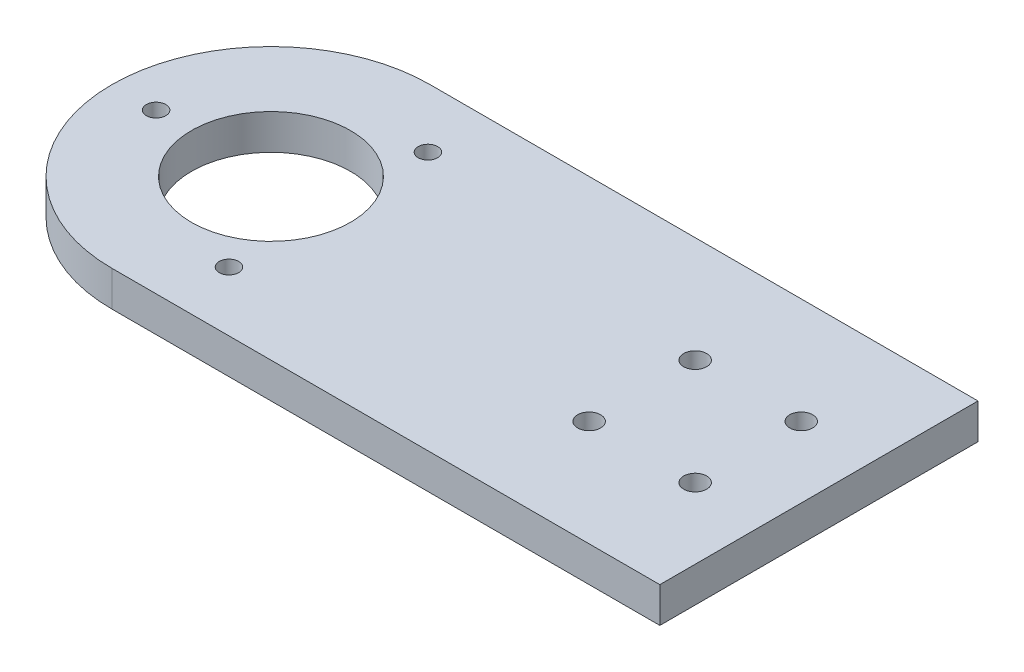
ISO-10303-21;
HEADER;
FILE_DESCRIPTION(('STEP AP214'),'2;1');
FILE_NAME('part.step','',(''),(''),'','','');
FILE_SCHEMA(('AUTOMOTIVE_DESIGN { 1 0 10303 214 1 1 1 1 }'));
ENDSEC;
DATA;
#1=APPLICATION_CONTEXT('core data for automotive mechanical design processes');
#2=APPLICATION_PROTOCOL_DEFINITION('international standard','automotive_design',2000,#1);
#3=PRODUCT_CONTEXT('',#1,'mechanical');
#4=PRODUCT('Part','Part','',(#3));
#5=PRODUCT_RELATED_PRODUCT_CATEGORY('part','',(#4));
#6=PRODUCT_DEFINITION_FORMATION('','',#4);
#7=PRODUCT_DEFINITION_CONTEXT('part definition',#1,'design');
#8=PRODUCT_DEFINITION('design','',#6,#7);
#9=PRODUCT_DEFINITION_SHAPE('','',#8);
#10=(LENGTH_UNIT() NAMED_UNIT(*) SI_UNIT(.MILLI.,.METRE.));
#11=(NAMED_UNIT(*) PLANE_ANGLE_UNIT() SI_UNIT($,.RADIAN.));
#12=(NAMED_UNIT(*) SI_UNIT($,.STERADIAN.) SOLID_ANGLE_UNIT());
#13=UNCERTAINTY_MEASURE_WITH_UNIT(LENGTH_MEASURE(1.E-05),#10,'distance_accuracy_value','');
#14=(GEOMETRIC_REPRESENTATION_CONTEXT(3) GLOBAL_UNCERTAINTY_ASSIGNED_CONTEXT((#13)) GLOBAL_UNIT_ASSIGNED_CONTEXT((#10,
#11,#12)) REPRESENTATION_CONTEXT('',''));
#15=CARTESIAN_POINT('',(0.,0.,0.));
#16=DIRECTION('',(0.,0.,1.));
#17=DIRECTION('',(1.,0.,0.));
#18=AXIS2_PLACEMENT_3D('',#15,#16,#17);
#19=CARTESIAN_POINT('',(0.,10.,-45.));
#20=DIRECTION('',(0.,0.,-1.));
#21=DIRECTION('',(-1.,0.,0.));
#22=AXIS2_PLACEMENT_3D('',#19,#20,#21);
#23=PLANE('',#22);
#24=DIRECTION('',(1.,0.,0.));
#25=VECTOR('',#24,1.);
#26=CARTESIAN_POINT('',(0.,0.,-45.));
#27=LINE('',#26,#25);
#28=CARTESIAN_POINT('',(-55.,0.,-45.));
#29=VERTEX_POINT('',#28);
#30=CARTESIAN_POINT('',(100.,0.,-45.));
#31=VERTEX_POINT('',#30);
#32=EDGE_CURVE('E98',#29,#31,#27,.T.);
#33=ORIENTED_EDGE('',*,*,#32,.F.);
#34=DIRECTION('',(0.,-1.,0.));
#35=VECTOR('',#34,1.);
#36=CARTESIAN_POINT('',(-55.,10.,-45.));
#37=LINE('',#36,#35);
#38=CARTESIAN_POINT('',(-55.,10.,-45.));
#39=VERTEX_POINT('',#38);
#40=EDGE_CURVE('E11',#39,#29,#37,.T.);
#41=ORIENTED_EDGE('',*,*,#40,.F.);
#42=DIRECTION('',(1.,0.,0.));
#43=VECTOR('',#42,1.);
#44=CARTESIAN_POINT('',(0.,10.,-45.));
#45=LINE('',#44,#43);
#46=CARTESIAN_POINT('',(100.,10.,-45.));
#47=VERTEX_POINT('',#46);
#48=EDGE_CURVE('E83',#39,#47,#45,.T.);
#49=ORIENTED_EDGE('',*,*,#48,.T.);
#50=DIRECTION('',(0.,-1.,0.));
#51=VECTOR('',#50,1.);
#52=CARTESIAN_POINT('',(100.,10.,-45.));
#53=LINE('',#52,#51);
#54=EDGE_CURVE('E51',#47,#31,#53,.T.);
#55=ORIENTED_EDGE('',*,*,#54,.T.);
#56=EDGE_LOOP('',(#33,#41,#49,#55));
#57=FACE_BOUND('',#56,.T.);
#58=ADVANCED_FACE('F35',(#57),#23,.T.);
#59=CARTESIAN_POINT('',(-55.,10.,0.));
#60=DIRECTION('',(0.,-1.,0.));
#61=DIRECTION('',(0.,0.,-1.));
#62=AXIS2_PLACEMENT_3D('',#59,#60,#61);
#63=CYLINDRICAL_SURFACE('',#62,45.);
#64=CARTESIAN_POINT('',(-55.,0.,0.));
#65=DIRECTION('',(0.,1.,0.));
#66=DIRECTION('',(0.,0.,1.));
#67=AXIS2_PLACEMENT_3D('',#64,#65,#66);
#68=CIRCLE('',#67,45.);
#69=CARTESIAN_POINT('',(-55.,0.,45.));
#70=VERTEX_POINT('',#69);
#71=EDGE_CURVE('E89',#29,#70,#68,.T.);
#72=ORIENTED_EDGE('',*,*,#71,.T.);
#73=DIRECTION('',(0.,-1.,0.));
#74=VECTOR('',#73,1.);
#75=CARTESIAN_POINT('',(-55.,10.,45.));
#76=LINE('',#75,#74);
#77=CARTESIAN_POINT('',(-55.,10.,45.));
#78=VERTEX_POINT('',#77);
#79=EDGE_CURVE('E43',#78,#70,#76,.T.);
#80=ORIENTED_EDGE('',*,*,#79,.F.);
#81=CARTESIAN_POINT('',(-55.,10.,0.));
#82=DIRECTION('',(0.,1.,0.));
#83=DIRECTION('',(0.,0.,1.));
#84=AXIS2_PLACEMENT_3D('',#81,#82,#83);
#85=CIRCLE('',#84,45.);
#86=EDGE_CURVE('E77',#39,#78,#85,.T.);
#87=ORIENTED_EDGE('',*,*,#86,.F.);
#88=ORIENTED_EDGE('',*,*,#40,.T.);
#89=EDGE_LOOP('',(#72,#80,#87,#88));
#90=FACE_BOUND('',#89,.T.);
#91=ADVANCED_FACE('F87',(#90),#63,.T.);
#92=CARTESIAN_POINT('',(0.,10.,45.));
#93=DIRECTION('',(0.,0.,1.));
#94=DIRECTION('',(1.,0.,0.));
#95=AXIS2_PLACEMENT_3D('',#92,#93,#94);
#96=PLANE('',#95);
#97=DIRECTION('',(-1.,0.,0.));
#98=VECTOR('',#97,1.);
#99=CARTESIAN_POINT('',(0.,0.,45.));
#100=LINE('',#99,#98);
#101=CARTESIAN_POINT('',(100.,0.,45.));
#102=VERTEX_POINT('',#101);
#103=EDGE_CURVE('E102',#102,#70,#100,.T.);
#104=ORIENTED_EDGE('',*,*,#103,.F.);
#105=DIRECTION('',(0.,-1.,0.));
#106=VECTOR('',#105,1.);
#107=CARTESIAN_POINT('',(100.,10.,45.));
#108=LINE('',#107,#106);
#109=CARTESIAN_POINT('',(100.,10.,45.));
#110=VERTEX_POINT('',#109);
#111=EDGE_CURVE('E64',#110,#102,#108,.T.);
#112=ORIENTED_EDGE('',*,*,#111,.F.);
#113=DIRECTION('',(-1.,0.,0.));
#114=VECTOR('',#113,1.);
#115=CARTESIAN_POINT('',(0.,10.,45.));
#116=LINE('',#115,#114);
#117=EDGE_CURVE('E82',#110,#78,#116,.T.);
#118=ORIENTED_EDGE('',*,*,#117,.T.);
#119=ORIENTED_EDGE('',*,*,#79,.T.);
#120=EDGE_LOOP('',(#104,#112,#118,#119));
#121=FACE_BOUND('',#120,.T.);
#122=ADVANCED_FACE('F92',(#121),#96,.T.);
#123=CARTESIAN_POINT('',(100.,10.,0.));
#124=DIRECTION('',(1.,0.,0.));
#125=DIRECTION('',(0.,0.,-1.));
#126=AXIS2_PLACEMENT_3D('',#123,#124,#125);
#127=PLANE('',#126);
#128=DIRECTION('',(0.,0.,1.));
#129=VECTOR('',#128,1.);
#130=CARTESIAN_POINT('',(100.,0.,0.));
#131=LINE('',#130,#129);
#132=EDGE_CURVE('E104',#31,#102,#131,.T.);
#133=ORIENTED_EDGE('',*,*,#132,.F.);
#134=ORIENTED_EDGE('',*,*,#54,.F.);
#135=DIRECTION('',(0.,0.,1.));
#136=VECTOR('',#135,1.);
#137=CARTESIAN_POINT('',(100.,10.,0.));
#138=LINE('',#137,#136);
#139=EDGE_CURVE('E93',#47,#110,#138,.T.);
#140=ORIENTED_EDGE('',*,*,#139,.T.);
#141=ORIENTED_EDGE('',*,*,#111,.T.);
#142=EDGE_LOOP('',(#133,#134,#140,#141));
#143=FACE_BOUND('',#142,.T.);
#144=ADVANCED_FACE('F163',(#143),#127,.T.);
#145=CARTESIAN_POINT('',(0.,10.,0.));
#146=DIRECTION('',(0.,1.,0.));
#147=DIRECTION('',(0.,0.,1.));
#148=AXIS2_PLACEMENT_3D('',#145,#146,#147);
#149=PLANE('',#148);
#150=CARTESIAN_POINT('',(50.,10.,15.));
#151=DIRECTION('',(0.,1.,0.));
#152=DIRECTION('',(0.,0.,1.));
#153=AXIS2_PLACEMENT_3D('',#150,#151,#152);
#154=CIRCLE('',#153,3.25);
#155=CARTESIAN_POINT('',(50.,10.,18.25));
#156=VERTEX_POINT('',#155);
#157=EDGE_CURVE('E143',#156,#156,#154,.T.);
#158=ORIENTED_EDGE('',*,*,#157,.F.);
#159=EDGE_LOOP('',(#158));
#160=FACE_BOUND('',#159,.T.);
#161=CARTESIAN_POINT('',(80.,10.,15.));
#162=DIRECTION('',(0.,1.,0.));
#163=DIRECTION('',(0.,0.,1.));
#164=AXIS2_PLACEMENT_3D('',#161,#162,#163);
#165=CIRCLE('',#164,3.25000000000001);
#166=CARTESIAN_POINT('',(80.,10.,18.25));
#167=VERTEX_POINT('',#166);
#168=EDGE_CURVE('E149',#167,#167,#165,.T.);
#169=ORIENTED_EDGE('',*,*,#168,.F.);
#170=EDGE_LOOP('',(#169));
#171=FACE_BOUND('',#170,.T.);
#172=CARTESIAN_POINT('',(80.,10.,-15.));
#173=DIRECTION('',(0.,1.,0.));
#174=DIRECTION('',(0.,0.,1.));
#175=AXIS2_PLACEMENT_3D('',#172,#173,#174);
#176=CIRCLE('',#175,3.25000000000001);
#177=CARTESIAN_POINT('',(80.,10.,-11.75));
#178=VERTEX_POINT('',#177);
#179=EDGE_CURVE('E137',#178,#178,#176,.T.);
#180=ORIENTED_EDGE('',*,*,#179,.F.);
#181=EDGE_LOOP('',(#180));
#182=FACE_BOUND('',#181,.T.);
#183=CARTESIAN_POINT('',(50.,10.,-15.));
#184=DIRECTION('',(0.,1.,0.));
#185=DIRECTION('',(0.,0.,1.));
#186=AXIS2_PLACEMENT_3D('',#183,#184,#185);
#187=CIRCLE('',#186,3.25);
#188=CARTESIAN_POINT('',(50.,10.,-11.75));
#189=VERTEX_POINT('',#188);
#190=EDGE_CURVE('E134',#189,#189,#187,.T.);
#191=ORIENTED_EDGE('',*,*,#190,.F.);
#192=EDGE_LOOP('',(#191));
#193=FACE_BOUND('',#192,.T.);
#194=CARTESIAN_POINT('',(-87.5,10.,0.));
#195=DIRECTION('',(0.,1.,0.));
#196=DIRECTION('',(0.,0.,1.));
#197=AXIS2_PLACEMENT_3D('',#194,#195,#196);
#198=CIRCLE('',#197,2.75000000000001);
#199=CARTESIAN_POINT('',(-87.5,10.,2.75000000000001));
#200=VERTEX_POINT('',#199);
#201=EDGE_CURVE('E129',#200,#200,#198,.T.);
#202=ORIENTED_EDGE('',*,*,#201,.F.);
#203=EDGE_LOOP('',(#202));
#204=FACE_BOUND('',#203,.T.);
#205=CARTESIAN_POINT('',(-55.,10.,0.));
#206=DIRECTION('',(0.,1.,0.));
#207=DIRECTION('',(0.,0.,1.));
#208=AXIS2_PLACEMENT_3D('',#205,#206,#207);
#209=CIRCLE('',#208,22.5);
#210=CARTESIAN_POINT('',(-55.,10.,22.5));
#211=VERTEX_POINT('',#210);
#212=EDGE_CURVE('E123',#211,#211,#209,.T.);
#213=ORIENTED_EDGE('',*,*,#212,.F.);
#214=EDGE_LOOP('',(#213));
#215=FACE_BOUND('',#214,.T.);
#216=CARTESIAN_POINT('',(-38.7499999999999,10.,-28.1458256229942));
#217=DIRECTION('',(0.,1.,0.));
#218=DIRECTION('',(0.,0.,1.));
#219=AXIS2_PLACEMENT_3D('',#216,#217,#218);
#220=CIRCLE('',#219,2.75000000000002);
#221=CARTESIAN_POINT('',(-38.7499999999999,10.,-25.3958256229942));
#222=VERTEX_POINT('',#221);
#223=EDGE_CURVE('E117',#222,#222,#220,.T.);
#224=ORIENTED_EDGE('',*,*,#223,.F.);
#225=EDGE_LOOP('',(#224));
#226=FACE_BOUND('',#225,.T.);
#227=CARTESIAN_POINT('',(-38.7500000000003,10.,28.1458256229944));
#228=DIRECTION('',(0.,1.,0.));
#229=DIRECTION('',(0.,0.,1.));
#230=AXIS2_PLACEMENT_3D('',#227,#228,#229);
#231=CIRCLE('',#230,2.75);
#232=CARTESIAN_POINT('',(-38.7500000000003,10.,30.8958256229944));
#233=VERTEX_POINT('',#232);
#234=EDGE_CURVE('E110',#233,#233,#231,.T.);
#235=ORIENTED_EDGE('',*,*,#234,.F.);
#236=EDGE_LOOP('',(#235));
#237=FACE_BOUND('',#236,.T.);
#238=ORIENTED_EDGE('',*,*,#48,.F.);
#239=ORIENTED_EDGE('',*,*,#86,.T.);
#240=ORIENTED_EDGE('',*,*,#117,.F.);
#241=ORIENTED_EDGE('',*,*,#139,.F.);
#242=EDGE_LOOP('',(#238,#239,#240,#241));
#243=FACE_BOUND('',#242,.T.);
#244=ADVANCED_FACE('F79',(#160,#171,#182,#193,#204,#215,#226,#237,#243),#149,.T.);
#245=CARTESIAN_POINT('',(0.,0.,0.));
#246=DIRECTION('',(0.,1.,0.));
#247=DIRECTION('',(0.,0.,1.));
#248=AXIS2_PLACEMENT_3D('',#245,#246,#247);
#249=PLANE('',#248);
#250=CARTESIAN_POINT('',(50.,0.,15.));
#251=DIRECTION('',(0.,1.,0.));
#252=DIRECTION('',(0.,0.,1.));
#253=AXIS2_PLACEMENT_3D('',#250,#251,#252);
#254=CIRCLE('',#253,3.25);
#255=CARTESIAN_POINT('',(50.,0.,18.25));
#256=VERTEX_POINT('',#255);
#257=EDGE_CURVE('E140',#256,#256,#254,.T.);
#258=ORIENTED_EDGE('',*,*,#257,.T.);
#259=EDGE_LOOP('',(#258));
#260=FACE_BOUND('',#259,.T.);
#261=CARTESIAN_POINT('',(80.,0.,15.));
#262=DIRECTION('',(0.,1.,0.));
#263=DIRECTION('',(0.,0.,1.));
#264=AXIS2_PLACEMENT_3D('',#261,#262,#263);
#265=CIRCLE('',#264,3.25000000000001);
#266=CARTESIAN_POINT('',(80.,0.,18.25));
#267=VERTEX_POINT('',#266);
#268=EDGE_CURVE('E146',#267,#267,#265,.T.);
#269=ORIENTED_EDGE('',*,*,#268,.T.);
#270=EDGE_LOOP('',(#269));
#271=FACE_BOUND('',#270,.T.);
#272=CARTESIAN_POINT('',(80.,0.,-15.));
#273=DIRECTION('',(0.,1.,0.));
#274=DIRECTION('',(0.,0.,1.));
#275=AXIS2_PLACEMENT_3D('',#272,#273,#274);
#276=CIRCLE('',#275,3.25000000000001);
#277=CARTESIAN_POINT('',(80.,0.,-11.75));
#278=VERTEX_POINT('',#277);
#279=EDGE_CURVE('E152',#278,#278,#276,.T.);
#280=ORIENTED_EDGE('',*,*,#279,.T.);
#281=EDGE_LOOP('',(#280));
#282=FACE_BOUND('',#281,.T.);
#283=CARTESIAN_POINT('',(50.,0.,-15.));
#284=DIRECTION('',(0.,1.,0.));
#285=DIRECTION('',(0.,0.,1.));
#286=AXIS2_PLACEMENT_3D('',#283,#284,#285);
#287=CIRCLE('',#286,3.25);
#288=CARTESIAN_POINT('',(50.,0.,-11.75));
#289=VERTEX_POINT('',#288);
#290=EDGE_CURVE('E114',#289,#289,#287,.T.);
#291=ORIENTED_EDGE('',*,*,#290,.T.);
#292=EDGE_LOOP('',(#291));
#293=FACE_BOUND('',#292,.T.);
#294=CARTESIAN_POINT('',(-87.5,0.,0.));
#295=DIRECTION('',(0.,1.,0.));
#296=DIRECTION('',(0.,0.,1.));
#297=AXIS2_PLACEMENT_3D('',#294,#295,#296);
#298=CIRCLE('',#297,2.75000000000001);
#299=CARTESIAN_POINT('',(-87.5,0.,2.75000000000001));
#300=VERTEX_POINT('',#299);
#301=EDGE_CURVE('E100',#300,#300,#298,.T.);
#302=ORIENTED_EDGE('',*,*,#301,.T.);
#303=EDGE_LOOP('',(#302));
#304=FACE_BOUND('',#303,.T.);
#305=CARTESIAN_POINT('',(-55.,0.,0.));
#306=DIRECTION('',(0.,1.,0.));
#307=DIRECTION('',(0.,0.,1.));
#308=AXIS2_PLACEMENT_3D('',#305,#306,#307);
#309=CIRCLE('',#308,22.5);
#310=CARTESIAN_POINT('',(-55.,0.,22.5));
#311=VERTEX_POINT('',#310);
#312=EDGE_CURVE('E126',#311,#311,#309,.T.);
#313=ORIENTED_EDGE('',*,*,#312,.T.);
#314=EDGE_LOOP('',(#313));
#315=FACE_BOUND('',#314,.T.);
#316=CARTESIAN_POINT('',(-38.7499999999999,0.,-28.1458256229942));
#317=DIRECTION('',(0.,1.,0.));
#318=DIRECTION('',(0.,0.,1.));
#319=AXIS2_PLACEMENT_3D('',#316,#317,#318);
#320=CIRCLE('',#319,2.75000000000002);
#321=CARTESIAN_POINT('',(-38.7499999999999,0.,-25.3958256229942));
#322=VERTEX_POINT('',#321);
#323=EDGE_CURVE('E120',#322,#322,#320,.T.);
#324=ORIENTED_EDGE('',*,*,#323,.T.);
#325=EDGE_LOOP('',(#324));
#326=FACE_BOUND('',#325,.T.);
#327=CARTESIAN_POINT('',(-38.7500000000003,0.,28.1458256229944));
#328=DIRECTION('',(0.,1.,0.));
#329=DIRECTION('',(0.,0.,1.));
#330=AXIS2_PLACEMENT_3D('',#327,#328,#329);
#331=CIRCLE('',#330,2.75);
#332=CARTESIAN_POINT('',(-38.7500000000003,0.,30.8958256229944));
#333=VERTEX_POINT('',#332);
#334=EDGE_CURVE('E113',#333,#333,#331,.T.);
#335=ORIENTED_EDGE('',*,*,#334,.T.);
#336=EDGE_LOOP('',(#335));
#337=FACE_BOUND('',#336,.T.);
#338=ORIENTED_EDGE('',*,*,#32,.T.);
#339=ORIENTED_EDGE('',*,*,#132,.T.);
#340=ORIENTED_EDGE('',*,*,#103,.T.);
#341=ORIENTED_EDGE('',*,*,#71,.F.);
#342=EDGE_LOOP('',(#338,#339,#340,#341));
#343=FACE_BOUND('',#342,.T.);
#344=ADVANCED_FACE('F162',(#260,#271,#282,#293,#304,#315,#326,#337,#343),#249,.F.);
#345=CARTESIAN_POINT('',(-38.7500000000003,0.,28.1458256229944));
#346=DIRECTION('',(0.,1.,0.));
#347=DIRECTION('',(0.,0.,1.));
#348=AXIS2_PLACEMENT_3D('',#345,#346,#347);
#349=CYLINDRICAL_SURFACE('',#348,2.75);
#350=ORIENTED_EDGE('',*,*,#334,.F.);
#351=EDGE_LOOP('',(#350));
#352=FACE_BOUND('',#351,.T.);
#353=ORIENTED_EDGE('',*,*,#234,.T.);
#354=EDGE_LOOP('',(#353));
#355=FACE_BOUND('',#354,.T.);
#356=ADVANCED_FACE('F176',(#352,#355),#349,.F.);
#357=CARTESIAN_POINT('',(-38.7499999999999,0.,-28.1458256229942));
#358=DIRECTION('',(0.,1.,0.));
#359=DIRECTION('',(0.,0.,1.));
#360=AXIS2_PLACEMENT_3D('',#357,#358,#359);
#361=CYLINDRICAL_SURFACE('',#360,2.75000000000002);
#362=ORIENTED_EDGE('',*,*,#323,.F.);
#363=EDGE_LOOP('',(#362));
#364=FACE_BOUND('',#363,.T.);
#365=ORIENTED_EDGE('',*,*,#223,.T.);
#366=EDGE_LOOP('',(#365));
#367=FACE_BOUND('',#366,.T.);
#368=ADVANCED_FACE('F178',(#364,#367),#361,.F.);
#369=CARTESIAN_POINT('',(-55.,0.,0.));
#370=DIRECTION('',(0.,1.,0.));
#371=DIRECTION('',(0.,0.,1.));
#372=AXIS2_PLACEMENT_3D('',#369,#370,#371);
#373=CYLINDRICAL_SURFACE('',#372,22.5);
#374=ORIENTED_EDGE('',*,*,#312,.F.);
#375=EDGE_LOOP('',(#374));
#376=FACE_BOUND('',#375,.T.);
#377=ORIENTED_EDGE('',*,*,#212,.T.);
#378=EDGE_LOOP('',(#377));
#379=FACE_BOUND('',#378,.T.);
#380=ADVANCED_FACE('F185',(#376,#379),#373,.F.);
#381=CARTESIAN_POINT('',(-87.5,0.,0.));
#382=DIRECTION('',(0.,1.,0.));
#383=DIRECTION('',(0.,0.,1.));
#384=AXIS2_PLACEMENT_3D('',#381,#382,#383);
#385=CYLINDRICAL_SURFACE('',#384,2.75000000000001);
#386=ORIENTED_EDGE('',*,*,#301,.F.);
#387=EDGE_LOOP('',(#386));
#388=FACE_BOUND('',#387,.T.);
#389=ORIENTED_EDGE('',*,*,#201,.T.);
#390=EDGE_LOOP('',(#389));
#391=FACE_BOUND('',#390,.T.);
#392=ADVANCED_FACE('F248',(#388,#391),#385,.F.);
#393=CARTESIAN_POINT('',(50.,0.,-15.));
#394=DIRECTION('',(0.,1.,0.));
#395=DIRECTION('',(0.,0.,1.));
#396=AXIS2_PLACEMENT_3D('',#393,#394,#395);
#397=CYLINDRICAL_SURFACE('',#396,3.25);
#398=ORIENTED_EDGE('',*,*,#290,.F.);
#399=EDGE_LOOP('',(#398));
#400=FACE_BOUND('',#399,.T.);
#401=ORIENTED_EDGE('',*,*,#190,.T.);
#402=EDGE_LOOP('',(#401));
#403=FACE_BOUND('',#402,.T.);
#404=ADVANCED_FACE('F256',(#400,#403),#397,.F.);
#405=CARTESIAN_POINT('',(80.,0.,-15.));
#406=DIRECTION('',(0.,1.,0.));
#407=DIRECTION('',(0.,0.,1.));
#408=AXIS2_PLACEMENT_3D('',#405,#406,#407);
#409=CYLINDRICAL_SURFACE('',#408,3.25000000000001);
#410=ORIENTED_EDGE('',*,*,#279,.F.);
#411=EDGE_LOOP('',(#410));
#412=FACE_BOUND('',#411,.T.);
#413=ORIENTED_EDGE('',*,*,#179,.T.);
#414=EDGE_LOOP('',(#413));
#415=FACE_BOUND('',#414,.T.);
#416=ADVANCED_FACE('F158',(#412,#415),#409,.F.);
#417=CARTESIAN_POINT('',(80.,0.,15.));
#418=DIRECTION('',(0.,1.,0.));
#419=DIRECTION('',(0.,0.,1.));
#420=AXIS2_PLACEMENT_3D('',#417,#418,#419);
#421=CYLINDRICAL_SURFACE('',#420,3.25000000000001);
#422=ORIENTED_EDGE('',*,*,#268,.F.);
#423=EDGE_LOOP('',(#422));
#424=FACE_BOUND('',#423,.T.);
#425=ORIENTED_EDGE('',*,*,#168,.T.);
#426=EDGE_LOOP('',(#425));
#427=FACE_BOUND('',#426,.T.);
#428=ADVANCED_FACE('F272',(#424,#427),#421,.F.);
#429=CARTESIAN_POINT('',(50.,0.,15.));
#430=DIRECTION('',(0.,1.,0.));
#431=DIRECTION('',(0.,0.,1.));
#432=AXIS2_PLACEMENT_3D('',#429,#430,#431);
#433=CYLINDRICAL_SURFACE('',#432,3.25);
#434=ORIENTED_EDGE('',*,*,#257,.F.);
#435=EDGE_LOOP('',(#434));
#436=FACE_BOUND('',#435,.T.);
#437=ORIENTED_EDGE('',*,*,#157,.T.);
#438=EDGE_LOOP('',(#437));
#439=FACE_BOUND('',#438,.T.);
#440=ADVANCED_FACE('F281',(#436,#439),#433,.F.);
#441=CLOSED_SHELL('',(#58,#91,#122,#144,#244,#344,#356,#368,#380,#392,#404,#416,#428,#440));
#442=MANIFOLD_SOLID_BREP('B2',#441);
#443=ADVANCED_BREP_SHAPE_REPRESENTATION('',(#18,#442),#14);
#444=SHAPE_DEFINITION_REPRESENTATION(#9,#443);
ENDSEC;
END-ISO-10303-21;
